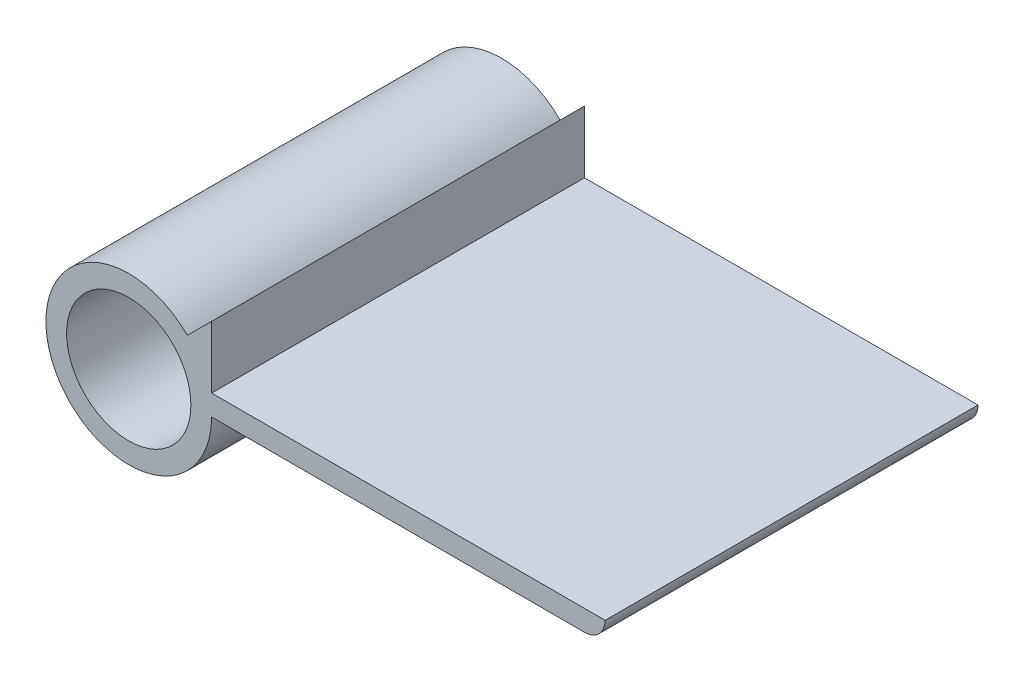
ISO-10303-21;
HEADER;
FILE_DESCRIPTION(('STEP AP214'),'2;1');
FILE_NAME('part.step','',(''),(''),'','','');
FILE_SCHEMA(('AUTOMOTIVE_DESIGN { 1 0 10303 214 1 1 1 1 }'));
ENDSEC;
DATA;
#1=APPLICATION_CONTEXT('core data for automotive mechanical design processes');
#2=APPLICATION_PROTOCOL_DEFINITION('international standard','automotive_design',2000,#1);
#3=PRODUCT_CONTEXT('',#1,'mechanical');
#4=PRODUCT('Part','Part','',(#3));
#5=PRODUCT_RELATED_PRODUCT_CATEGORY('part','',(#4));
#6=PRODUCT_DEFINITION_FORMATION('','',#4);
#7=PRODUCT_DEFINITION_CONTEXT('part definition',#1,'design');
#8=PRODUCT_DEFINITION('design','',#6,#7);
#9=PRODUCT_DEFINITION_SHAPE('','',#8);
#10=(LENGTH_UNIT() NAMED_UNIT(*) SI_UNIT(.MILLI.,.METRE.));
#11=(NAMED_UNIT(*) PLANE_ANGLE_UNIT() SI_UNIT($,.RADIAN.));
#12=(NAMED_UNIT(*) SI_UNIT($,.STERADIAN.) SOLID_ANGLE_UNIT());
#13=UNCERTAINTY_MEASURE_WITH_UNIT(LENGTH_MEASURE(1.E-05),#10,'distance_accuracy_value','');
#14=(GEOMETRIC_REPRESENTATION_CONTEXT(3) GLOBAL_UNCERTAINTY_ASSIGNED_CONTEXT((#13)) GLOBAL_UNIT_ASSIGNED_CONTEXT((#10,
#11,#12)) REPRESENTATION_CONTEXT('',''));
#15=CARTESIAN_POINT('',(0.,0.,0.));
#16=DIRECTION('',(0.,0.,1.));
#17=DIRECTION('',(1.,0.,0.));
#18=AXIS2_PLACEMENT_3D('',#15,#16,#17);
#19=CARTESIAN_POINT('',(44.,2.,36.));
#20=DIRECTION('',(0.,0.,-1.));
#21=DIRECTION('',(-1.,0.,0.));
#22=AXIS2_PLACEMENT_3D('',#19,#20,#21);
#23=PLANE('',#22);
#24=CARTESIAN_POINT('',(44.,2.,36.));
#25=DIRECTION('',(0.,0.,1.));
#26=DIRECTION('',(-1.,0.,0.));
#27=AXIS2_PLACEMENT_3D('',#24,#25,#26);
#28=CIRCLE('',#27,2.);
#29=CARTESIAN_POINT('',(44.,0.,36.));
#30=VERTEX_POINT('',#29);
#31=CARTESIAN_POINT('',(46.,2.,36.));
#32=VERTEX_POINT('',#31);
#33=EDGE_CURVE('E132',#30,#32,#28,.T.);
#34=ORIENTED_EDGE('',*,*,#33,.T.);
#35=DIRECTION('',(-1.,0.,0.));
#36=VECTOR('',#35,1.);
#37=CARTESIAN_POINT('',(46.,2.,36.));
#38=LINE('',#37,#36);
#39=CARTESIAN_POINT('',(8.,2.,36.));
#40=VERTEX_POINT('',#39);
#41=EDGE_CURVE('E90',#32,#40,#38,.T.);
#42=ORIENTED_EDGE('',*,*,#41,.T.);
#43=DIRECTION('',(0.,1.,0.));
#44=VECTOR('',#43,1.);
#45=CARTESIAN_POINT('',(8.,2.,36.));
#46=LINE('',#45,#44);
#47=CARTESIAN_POINT('',(8.,8.,36.));
#48=VERTEX_POINT('',#47);
#49=EDGE_CURVE('E103',#40,#48,#46,.T.);
#50=ORIENTED_EDGE('',*,*,#49,.T.);
#51=DIRECTION('',(-0.707106781186544,-0.707106781186551,0.));
#52=VECTOR('',#51,1.);
#53=CARTESIAN_POINT('',(8.,8.,36.));
#54=LINE('',#53,#52);
#55=CARTESIAN_POINT('',(5.65685424949239,5.65685424949237,36.));
#56=VERTEX_POINT('',#55);
#57=EDGE_CURVE('E97',#48,#56,#54,.T.);
#58=ORIENTED_EDGE('',*,*,#57,.T.);
#59=CARTESIAN_POINT('',(0.,0.,36.));
#60=DIRECTION('',(0.,0.,1.));
#61=DIRECTION('',(1.,0.,0.));
#62=AXIS2_PLACEMENT_3D('',#59,#60,#61);
#63=CIRCLE('',#62,8.);
#64=CARTESIAN_POINT('',(8.,0.,36.));
#65=VERTEX_POINT('',#64);
#66=EDGE_CURVE('E101',#56,#65,#63,.T.);
#67=ORIENTED_EDGE('',*,*,#66,.T.);
#68=DIRECTION('',(1.,0.,0.));
#69=VECTOR('',#68,1.);
#70=CARTESIAN_POINT('',(8.,0.,36.));
#71=LINE('',#70,#69);
#72=EDGE_CURVE('E53',#65,#30,#71,.T.);
#73=ORIENTED_EDGE('',*,*,#72,.T.);
#74=EDGE_LOOP('',(#34,#42,#50,#58,#67,#73));
#75=FACE_BOUND('',#74,.T.);
#76=CARTESIAN_POINT('',(0.,0.,36.));
#77=DIRECTION('',(0.,0.,1.));
#78=DIRECTION('',(1.,0.,0.));
#79=AXIS2_PLACEMENT_3D('',#76,#77,#78);
#80=CIRCLE('',#79,6.);
#81=CARTESIAN_POINT('',(6.,0.,36.));
#82=VERTEX_POINT('',#81);
#83=EDGE_CURVE('E125',#82,#82,#80,.T.);
#84=ORIENTED_EDGE('',*,*,#83,.F.);
#85=EDGE_LOOP('',(#84));
#86=FACE_BOUND('',#85,.T.);
#87=ADVANCED_FACE('F36',(#75,#86),#23,.F.);
#88=CARTESIAN_POINT('',(44.,2.,0.));
#89=DIRECTION('',(0.,0.,-1.));
#90=DIRECTION('',(-1.,0.,0.));
#91=AXIS2_PLACEMENT_3D('',#88,#89,#90);
#92=PLANE('',#91);
#93=CARTESIAN_POINT('',(44.,2.,0.));
#94=DIRECTION('',(0.,0.,1.));
#95=DIRECTION('',(-1.,0.,0.));
#96=AXIS2_PLACEMENT_3D('',#93,#94,#95);
#97=CIRCLE('',#96,2.);
#98=CARTESIAN_POINT('',(44.,0.,0.));
#99=VERTEX_POINT('',#98);
#100=CARTESIAN_POINT('',(46.,2.,0.));
#101=VERTEX_POINT('',#100);
#102=EDGE_CURVE('E121',#99,#101,#97,.T.);
#103=ORIENTED_EDGE('',*,*,#102,.F.);
#104=DIRECTION('',(1.,0.,0.));
#105=VECTOR('',#104,1.);
#106=CARTESIAN_POINT('',(8.,0.,0.));
#107=LINE('',#106,#105);
#108=CARTESIAN_POINT('',(8.,0.,0.));
#109=VERTEX_POINT('',#108);
#110=EDGE_CURVE('E82',#109,#99,#107,.T.);
#111=ORIENTED_EDGE('',*,*,#110,.F.);
#112=CARTESIAN_POINT('',(0.,0.,0.));
#113=DIRECTION('',(0.,0.,1.));
#114=DIRECTION('',(1.,0.,0.));
#115=AXIS2_PLACEMENT_3D('',#112,#113,#114);
#116=CIRCLE('',#115,8.);
#117=CARTESIAN_POINT('',(5.65685424949239,5.65685424949237,0.));
#118=VERTEX_POINT('',#117);
#119=EDGE_CURVE('E76',#118,#109,#116,.T.);
#120=ORIENTED_EDGE('',*,*,#119,.F.);
#121=DIRECTION('',(-0.707106781186544,-0.707106781186551,0.));
#122=VECTOR('',#121,1.);
#123=CARTESIAN_POINT('',(8.,8.,0.));
#124=LINE('',#123,#122);
#125=CARTESIAN_POINT('',(8.,8.,0.));
#126=VERTEX_POINT('',#125);
#127=EDGE_CURVE('E111',#126,#118,#124,.T.);
#128=ORIENTED_EDGE('',*,*,#127,.F.);
#129=DIRECTION('',(0.,1.,0.));
#130=VECTOR('',#129,1.);
#131=CARTESIAN_POINT('',(8.,2.,0.));
#132=LINE('',#131,#130);
#133=CARTESIAN_POINT('',(8.,2.,0.));
#134=VERTEX_POINT('',#133);
#135=EDGE_CURVE('E127',#134,#126,#132,.T.);
#136=ORIENTED_EDGE('',*,*,#135,.F.);
#137=DIRECTION('',(-1.,0.,0.));
#138=VECTOR('',#137,1.);
#139=CARTESIAN_POINT('',(46.,2.,0.));
#140=LINE('',#139,#138);
#141=EDGE_CURVE('E124',#101,#134,#140,.T.);
#142=ORIENTED_EDGE('',*,*,#141,.F.);
#143=EDGE_LOOP('',(#103,#111,#120,#128,#136,#142));
#144=FACE_BOUND('',#143,.T.);
#145=CARTESIAN_POINT('',(0.,0.,0.));
#146=DIRECTION('',(0.,0.,1.));
#147=DIRECTION('',(1.,0.,0.));
#148=AXIS2_PLACEMENT_3D('',#145,#146,#147);
#149=CIRCLE('',#148,6.);
#150=CARTESIAN_POINT('',(6.,0.,0.));
#151=VERTEX_POINT('',#150);
#152=EDGE_CURVE('E225',#151,#151,#149,.T.);
#153=ORIENTED_EDGE('',*,*,#152,.T.);
#154=EDGE_LOOP('',(#153));
#155=FACE_BOUND('',#154,.T.);
#156=ADVANCED_FACE('F141',(#144,#155),#92,.T.);
#157=CARTESIAN_POINT('',(44.,2.,36.));
#158=DIRECTION('',(0.,0.,-1.));
#159=DIRECTION('',(-1.,0.,0.));
#160=AXIS2_PLACEMENT_3D('',#157,#158,#159);
#161=CYLINDRICAL_SURFACE('',#160,2.);
#162=ORIENTED_EDGE('',*,*,#102,.T.);
#163=DIRECTION('',(0.,0.,-1.));
#164=VECTOR('',#163,1.);
#165=CARTESIAN_POINT('',(46.,2.,36.));
#166=LINE('',#165,#164);
#167=EDGE_CURVE('E11',#32,#101,#166,.T.);
#168=ORIENTED_EDGE('',*,*,#167,.F.);
#169=ORIENTED_EDGE('',*,*,#33,.F.);
#170=DIRECTION('',(0.,0.,-1.));
#171=VECTOR('',#170,1.);
#172=CARTESIAN_POINT('',(44.,0.,36.));
#173=LINE('',#172,#171);
#174=EDGE_CURVE('E117',#30,#99,#173,.T.);
#175=ORIENTED_EDGE('',*,*,#174,.T.);
#176=EDGE_LOOP('',(#162,#168,#169,#175));
#177=FACE_BOUND('',#176,.T.);
#178=ADVANCED_FACE('F38',(#177),#161,.T.);
#179=CARTESIAN_POINT('',(46.,2.,36.));
#180=DIRECTION('',(0.,-1.,0.));
#181=DIRECTION('',(1.,0.,0.));
#182=AXIS2_PLACEMENT_3D('',#179,#180,#181);
#183=PLANE('',#182);
#184=ORIENTED_EDGE('',*,*,#141,.T.);
#185=DIRECTION('',(0.,0.,-1.));
#186=VECTOR('',#185,1.);
#187=CARTESIAN_POINT('',(8.,2.,36.));
#188=LINE('',#187,#186);
#189=EDGE_CURVE('E45',#40,#134,#188,.T.);
#190=ORIENTED_EDGE('',*,*,#189,.F.);
#191=ORIENTED_EDGE('',*,*,#41,.F.);
#192=ORIENTED_EDGE('',*,*,#167,.T.);
#193=EDGE_LOOP('',(#184,#190,#191,#192));
#194=FACE_BOUND('',#193,.T.);
#195=ADVANCED_FACE('F166',(#194),#183,.F.);
#196=CARTESIAN_POINT('',(8.,2.,36.));
#197=DIRECTION('',(-1.,0.,0.));
#198=DIRECTION('',(0.,0.,1.));
#199=AXIS2_PLACEMENT_3D('',#196,#197,#198);
#200=PLANE('',#199);
#201=ORIENTED_EDGE('',*,*,#135,.T.);
#202=DIRECTION('',(0.,0.,-1.));
#203=VECTOR('',#202,1.);
#204=CARTESIAN_POINT('',(8.,8.,36.));
#205=LINE('',#204,#203);
#206=EDGE_CURVE('E112',#48,#126,#205,.T.);
#207=ORIENTED_EDGE('',*,*,#206,.F.);
#208=ORIENTED_EDGE('',*,*,#49,.F.);
#209=ORIENTED_EDGE('',*,*,#189,.T.);
#210=EDGE_LOOP('',(#201,#207,#208,#209));
#211=FACE_BOUND('',#210,.T.);
#212=ADVANCED_FACE('F138',(#211),#200,.F.);
#213=CARTESIAN_POINT('',(8.,8.,36.));
#214=DIRECTION('',(0.707106781186551,-0.707106781186543,0.));
#215=DIRECTION('',(0.707106781186544,0.707106781186551,0.));
#216=AXIS2_PLACEMENT_3D('',#213,#214,#215);
#217=PLANE('',#216);
#218=ORIENTED_EDGE('',*,*,#127,.T.);
#219=DIRECTION('',(0.,0.,-1.));
#220=VECTOR('',#219,1.);
#221=CARTESIAN_POINT('',(5.65685424949239,5.65685424949237,36.));
#222=LINE('',#221,#220);
#223=EDGE_CURVE('E108',#56,#118,#222,.T.);
#224=ORIENTED_EDGE('',*,*,#223,.F.);
#225=ORIENTED_EDGE('',*,*,#57,.F.);
#226=ORIENTED_EDGE('',*,*,#206,.T.);
#227=EDGE_LOOP('',(#218,#224,#225,#226));
#228=FACE_BOUND('',#227,.T.);
#229=ADVANCED_FACE('F109',(#228),#217,.F.);
#230=CARTESIAN_POINT('',(0.,0.,36.));
#231=DIRECTION('',(0.,0.,-1.));
#232=DIRECTION('',(-1.,0.,0.));
#233=AXIS2_PLACEMENT_3D('',#230,#231,#232);
#234=CYLINDRICAL_SURFACE('',#233,8.);
#235=ORIENTED_EDGE('',*,*,#119,.T.);
#236=DIRECTION('',(0.,0.,-1.));
#237=VECTOR('',#236,1.);
#238=CARTESIAN_POINT('',(8.,0.,36.));
#239=LINE('',#238,#237);
#240=EDGE_CURVE('E113',#65,#109,#239,.T.);
#241=ORIENTED_EDGE('',*,*,#240,.F.);
#242=ORIENTED_EDGE('',*,*,#66,.F.);
#243=ORIENTED_EDGE('',*,*,#223,.T.);
#244=EDGE_LOOP('',(#235,#241,#242,#243));
#245=FACE_BOUND('',#244,.T.);
#246=ADVANCED_FACE('F115',(#245),#234,.T.);
#247=CARTESIAN_POINT('',(8.,0.,36.));
#248=DIRECTION('',(0.,1.,0.));
#249=DIRECTION('',(0.,0.,1.));
#250=AXIS2_PLACEMENT_3D('',#247,#248,#249);
#251=PLANE('',#250);
#252=ORIENTED_EDGE('',*,*,#110,.T.);
#253=ORIENTED_EDGE('',*,*,#174,.F.);
#254=ORIENTED_EDGE('',*,*,#72,.F.);
#255=ORIENTED_EDGE('',*,*,#240,.T.);
#256=EDGE_LOOP('',(#252,#253,#254,#255));
#257=FACE_BOUND('',#256,.T.);
#258=ADVANCED_FACE('F146',(#257),#251,.F.);
#259=CARTESIAN_POINT('',(0.,0.,36.));
#260=DIRECTION('',(0.,0.,-1.));
#261=DIRECTION('',(-1.,0.,0.));
#262=AXIS2_PLACEMENT_3D('',#259,#260,#261);
#263=CYLINDRICAL_SURFACE('',#262,6.);
#264=ORIENTED_EDGE('',*,*,#83,.T.);
#265=EDGE_LOOP('',(#264));
#266=FACE_BOUND('',#265,.T.);
#267=ORIENTED_EDGE('',*,*,#152,.F.);
#268=EDGE_LOOP('',(#267));
#269=FACE_BOUND('',#268,.T.);
#270=ADVANCED_FACE('F148',(#266,#269),#263,.F.);
#271=CLOSED_SHELL('',(#87,#156,#178,#195,#212,#229,#246,#258,#270));
#272=MANIFOLD_SOLID_BREP('B2',#271);
#273=ADVANCED_BREP_SHAPE_REPRESENTATION('',(#18,#272),#14);
#274=SHAPE_DEFINITION_REPRESENTATION(#9,#273);
ENDSEC;
END-ISO-10303-21;
